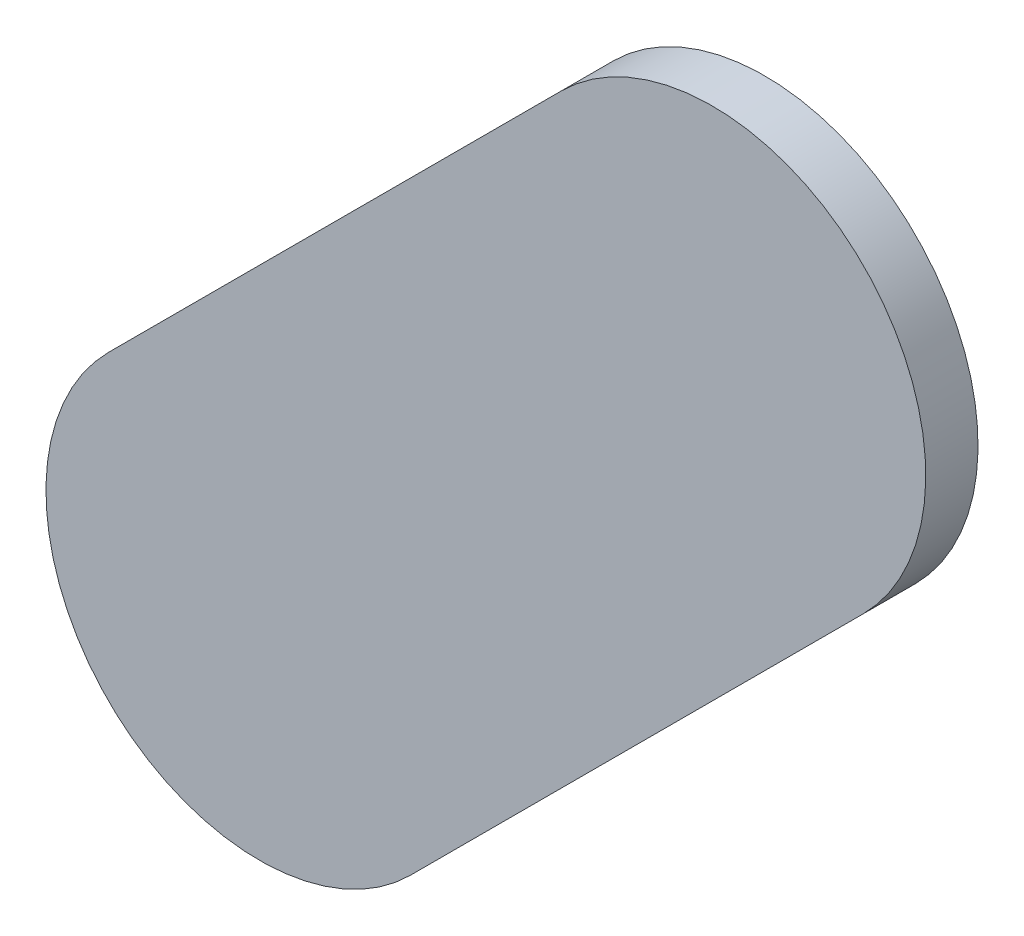
ISO-10303-21;
HEADER;
FILE_DESCRIPTION(('STEP AP214'),'2;1');
FILE_NAME('part.step','',(''),(''),'','','');
FILE_SCHEMA(('AUTOMOTIVE_DESIGN { 1 0 10303 214 1 1 1 1 }'));
ENDSEC;
DATA;
#1=APPLICATION_CONTEXT('core data for automotive mechanical design processes');
#2=APPLICATION_PROTOCOL_DEFINITION('international standard','automotive_design',2000,#1);
#3=PRODUCT_CONTEXT('',#1,'mechanical');
#4=PRODUCT('Part','Part','',(#3));
#5=PRODUCT_RELATED_PRODUCT_CATEGORY('part','',(#4));
#6=PRODUCT_DEFINITION_FORMATION('','',#4);
#7=PRODUCT_DEFINITION_CONTEXT('part definition',#1,'design');
#8=PRODUCT_DEFINITION('design','',#6,#7);
#9=PRODUCT_DEFINITION_SHAPE('','',#8);
#10=(LENGTH_UNIT() NAMED_UNIT(*) SI_UNIT(.MILLI.,.METRE.));
#11=(NAMED_UNIT(*) PLANE_ANGLE_UNIT() SI_UNIT($,.RADIAN.));
#12=(NAMED_UNIT(*) SI_UNIT($,.STERADIAN.) SOLID_ANGLE_UNIT());
#13=UNCERTAINTY_MEASURE_WITH_UNIT(LENGTH_MEASURE(1.E-05),#10,'distance_accuracy_value','');
#14=(GEOMETRIC_REPRESENTATION_CONTEXT(3) GLOBAL_UNCERTAINTY_ASSIGNED_CONTEXT((#13)) GLOBAL_UNIT_ASSIGNED_CONTEXT((#10,
#11,#12)) REPRESENTATION_CONTEXT('',''));
#15=CARTESIAN_POINT('',(0.,0.,0.));
#16=DIRECTION('',(0.,0.,1.));
#17=DIRECTION('',(1.,0.,0.));
#18=AXIS2_PLACEMENT_3D('',#15,#16,#17);
#19=CARTESIAN_POINT('',(8.25151875598,5.556644644531,0.79916));
#20=DIRECTION('',(0.,0.,1.));
#21=DIRECTION('',(1.,0.,0.));
#22=AXIS2_PLACEMENT_3D('',#19,#20,#21);
#23=PLANE('',#22);
#24=CARTESIAN_POINT('',(8.103026,5.408152,0.79916));
#25=DIRECTION('',(0.,0.,1.));
#26=DIRECTION('',(1.,0.,0.));
#27=AXIS2_PLACEMENT_3D('',#24,#25,#26);
#28=CIRCLE('',#27,0.139999667);
#29=CARTESIAN_POINT('',(8.20202131612215,5.30915731612204,0.79916));
#30=VERTEX_POINT('',#29);
#31=CARTESIAN_POINT('',(8.00403140491727,5.50714683271486,0.79916));
#32=VERTEX_POINT('',#31);
#33=EDGE_CURVE('E20',#30,#32,#28,.F.);
#34=ORIENTED_EDGE('',*,*,#33,.F.);
#35=DIRECTION('',(-0.707106660628037,-0.707106901745037,0.));
#36=VECTOR('',#35,1.);
#37=CARTESIAN_POINT('',(8.499005949366,5.606142050635,0.79916));
#38=LINE('',#37,#36);
#39=CARTESIAN_POINT('',(8.49900612430481,5.60614222557388,0.79916));
#40=VERTEX_POINT('',#39);
#41=EDGE_CURVE('E65',#30,#40,#38,.F.);
#42=ORIENTED_EDGE('',*,*,#41,.T.);
#43=CARTESIAN_POINT('',(8.400011,5.705137101268,0.79916));
#44=DIRECTION('',(0.,0.,1.));
#45=DIRECTION('',(1.,0.,0.));
#46=AXIS2_PLACEMENT_3D('',#43,#44,#45);
#47=CIRCLE('',#46,0.14);
#48=CARTESIAN_POINT('',(8.30101597763338,5.80413197763353,0.79916));
#49=VERTEX_POINT('',#48);
#50=EDGE_CURVE('E57',#49,#40,#47,.F.);
#51=ORIENTED_EDGE('',*,*,#50,.F.);
#52=DIRECTION('',(0.707106099992719,0.707107462379719,0.));
#53=VECTOR('',#52,1.);
#54=CARTESIAN_POINT('',(8.0040316191,5.507147046898,0.79916));
#55=LINE('',#54,#53);
#56=EDGE_CURVE('E64',#49,#32,#55,.F.);
#57=ORIENTED_EDGE('',*,*,#56,.T.);
#58=EDGE_LOOP('',(#34,#42,#51,#57));
#59=FACE_BOUND('',#58,.T.);
#60=ADVANCED_FACE('F17',(#59),#23,.T.);
#61=CARTESIAN_POINT('',(8.499005949366,5.606142050635,0.76487));
#62=DIRECTION('',(-0.707106901745037,0.707106660628037,0.));
#63=DIRECTION('',(-0.707106660628037,-0.707106901745037,0.));
#64=AXIS2_PLACEMENT_3D('',#61,#62,#63);
#65=PLANE('',#64);
#66=DIRECTION('',(0.,0.,1.));
#67=VECTOR('',#66,1.);
#68=CARTESIAN_POINT('',(8.2020213330001,5.3091573329999,0.76487));
#69=LINE('',#68,#67);
#70=CARTESIAN_POINT('',(8.20202131612214,5.30915731612203,0.76487));
#71=VERTEX_POINT('',#70);
#72=EDGE_CURVE('E68',#71,#30,#69,.T.);
#73=ORIENTED_EDGE('',*,*,#72,.F.);
#74=DIRECTION('',(-0.70710666062813,-0.707106901744944,0.));
#75=VECTOR('',#74,1.);
#76=CARTESIAN_POINT('',(8.499005949366,5.606142050635,0.76487));
#77=LINE('',#76,#75);
#78=CARTESIAN_POINT('',(8.49900612430481,5.60614222557387,0.76487));
#79=VERTEX_POINT('',#78);
#80=EDGE_CURVE('E72',#79,#71,#77,.T.);
#81=ORIENTED_EDGE('',*,*,#80,.F.);
#82=DIRECTION('',(0.,0.,1.));
#83=VECTOR('',#82,1.);
#84=CARTESIAN_POINT('',(8.499005949366,5.606142050635,0.76487));
#85=LINE('',#84,#83);
#86=EDGE_CURVE('E60',#40,#79,#85,.F.);
#87=ORIENTED_EDGE('',*,*,#86,.F.);
#88=ORIENTED_EDGE('',*,*,#41,.F.);
#89=EDGE_LOOP('',(#73,#81,#87,#88));
#90=FACE_BOUND('',#89,.T.);
#91=ADVANCED_FACE('F70',(#90),#65,.F.);
#92=CARTESIAN_POINT('',(8.103026,5.408152,0.76487));
#93=DIRECTION('',(0.,0.,1.));
#94=DIRECTION('',(1.,0.,0.));
#95=AXIS2_PLACEMENT_3D('',#92,#93,#94);
#96=CYLINDRICAL_SURFACE('',#95,0.139999667);
#97=DIRECTION('',(0.,0.,1.));
#98=VECTOR('',#97,1.);
#99=CARTESIAN_POINT('',(8.0040316191,5.507147046898,0.76487));
#100=LINE('',#99,#98);
#101=CARTESIAN_POINT('',(8.00403140491729,5.50714683271488,0.76487));
#102=VERTEX_POINT('',#101);
#103=EDGE_CURVE('E77',#32,#102,#100,.F.);
#104=ORIENTED_EDGE('',*,*,#103,.T.);
#105=CARTESIAN_POINT('',(8.103026333,5.408152231732,0.76487));
#106=DIRECTION('',(0.,0.,1.));
#107=DIRECTION('',(1.,0.,0.));
#108=AXIS2_PLACEMENT_3D('',#105,#106,#107);
#109=CIRCLE('',#108,0.14);
#110=EDGE_CURVE('E26',#71,#102,#109,.F.);
#111=ORIENTED_EDGE('',*,*,#110,.F.);
#112=ORIENTED_EDGE('',*,*,#72,.T.);
#113=ORIENTED_EDGE('',*,*,#33,.T.);
#114=EDGE_LOOP('',(#104,#111,#112,#113));
#115=FACE_BOUND('',#114,.T.);
#116=ADVANCED_FACE('F88',(#115),#96,.T.);
#117=CARTESIAN_POINT('',(8.0040316191,5.507147046898,0.76487));
#118=DIRECTION('',(0.707107462379719,-0.707106099992719,0.));
#119=DIRECTION('',(0.707106099992719,0.707107462379719,0.));
#120=AXIS2_PLACEMENT_3D('',#117,#118,#119);
#121=PLANE('',#120);
#122=DIRECTION('',(0.,0.,1.));
#123=VECTOR('',#122,1.);
#124=CARTESIAN_POINT('',(8.3010159999999,5.8041320000001,0.76487));
#125=LINE('',#124,#123);
#126=CARTESIAN_POINT('',(8.30101597763344,5.8041319776335,0.76487));
#127=VERTEX_POINT('',#126);
#128=EDGE_CURVE('E62',#127,#49,#125,.T.);
#129=ORIENTED_EDGE('',*,*,#128,.F.);
#130=DIRECTION('',(0.70710609999295,0.707107462379489,0.));
#131=VECTOR('',#130,1.);
#132=CARTESIAN_POINT('',(8.0040316191,5.507147046898,0.76487));
#133=LINE('',#132,#131);
#134=EDGE_CURVE('E11',#102,#127,#133,.T.);
#135=ORIENTED_EDGE('',*,*,#134,.F.);
#136=ORIENTED_EDGE('',*,*,#103,.F.);
#137=ORIENTED_EDGE('',*,*,#56,.F.);
#138=EDGE_LOOP('',(#129,#135,#136,#137));
#139=FACE_BOUND('',#138,.T.);
#140=ADVANCED_FACE('F96',(#139),#121,.F.);
#141=CARTESIAN_POINT('',(8.400011,5.705137101268,0.76487));
#142=DIRECTION('',(0.,0.,1.));
#143=DIRECTION('',(1.,0.,0.));
#144=AXIS2_PLACEMENT_3D('',#141,#142,#143);
#145=CYLINDRICAL_SURFACE('',#144,0.14);
#146=CARTESIAN_POINT('',(8.400011333,5.705137333,0.76487));
#147=DIRECTION('',(0.,0.,1.));
#148=DIRECTION('',(1.,0.,0.));
#149=AXIS2_PLACEMENT_3D('',#146,#147,#148);
#150=CIRCLE('',#149,0.14);
#151=EDGE_CURVE('E35',#127,#79,#150,.F.);
#152=ORIENTED_EDGE('',*,*,#151,.F.);
#153=ORIENTED_EDGE('',*,*,#128,.T.);
#154=ORIENTED_EDGE('',*,*,#50,.T.);
#155=ORIENTED_EDGE('',*,*,#86,.T.);
#156=EDGE_LOOP('',(#152,#153,#154,#155));
#157=FACE_BOUND('',#156,.T.);
#158=ADVANCED_FACE('F58',(#157),#145,.T.);
#159=CARTESIAN_POINT('',(8.25151875598,5.556644644531,0.76487));
#160=DIRECTION('',(0.,0.,-1.));
#161=DIRECTION('',(-1.,0.,0.));
#162=AXIS2_PLACEMENT_3D('',#159,#160,#161);
#163=PLANE('',#162);
#164=ORIENTED_EDGE('',*,*,#134,.T.);
#165=ORIENTED_EDGE('',*,*,#151,.T.);
#166=ORIENTED_EDGE('',*,*,#80,.T.);
#167=ORIENTED_EDGE('',*,*,#110,.T.);
#168=EDGE_LOOP('',(#164,#165,#166,#167));
#169=FACE_BOUND('',#168,.T.);
#170=ADVANCED_FACE('F89',(#169),#163,.T.);
#171=CLOSED_SHELL('',(#60,#91,#116,#140,#158,#170));
#172=MANIFOLD_SOLID_BREP('B1',#171);
#173=ADVANCED_BREP_SHAPE_REPRESENTATION('',(#18,#172),#14);
#174=SHAPE_DEFINITION_REPRESENTATION(#9,#173);
ENDSEC;
END-ISO-10303-21;
